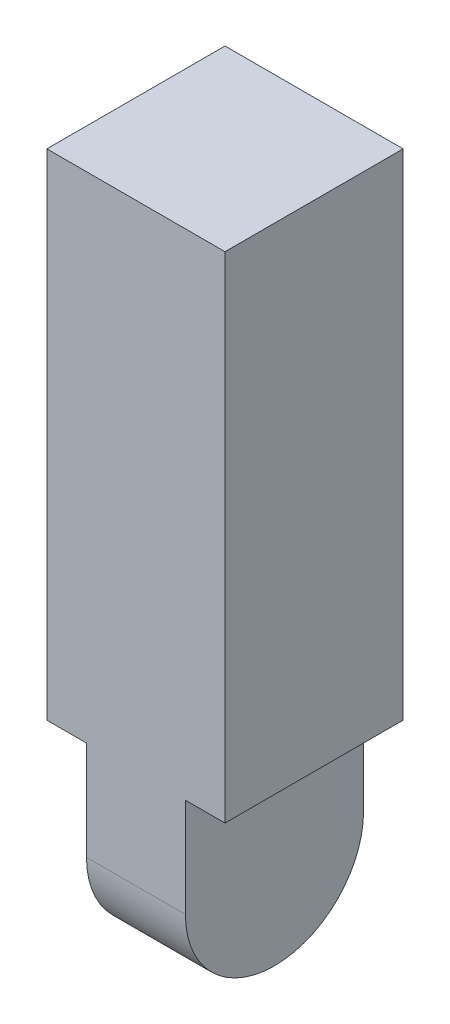
ISO-10303-21;
HEADER;
FILE_DESCRIPTION(('STEP AP214'),'2;1');
FILE_NAME('part.step','',(''),(''),'','','');
FILE_SCHEMA(('AUTOMOTIVE_DESIGN { 1 0 10303 214 1 1 1 1 }'));
ENDSEC;
DATA;
#1=APPLICATION_CONTEXT('core data for automotive mechanical design processes');
#2=APPLICATION_PROTOCOL_DEFINITION('international standard','automotive_design',2000,#1);
#3=PRODUCT_CONTEXT('',#1,'mechanical');
#4=PRODUCT('Part','Part','',(#3));
#5=PRODUCT_RELATED_PRODUCT_CATEGORY('part','',(#4));
#6=PRODUCT_DEFINITION_FORMATION('','',#4);
#7=PRODUCT_DEFINITION_CONTEXT('part definition',#1,'design');
#8=PRODUCT_DEFINITION('design','',#6,#7);
#9=PRODUCT_DEFINITION_SHAPE('','',#8);
#10=(LENGTH_UNIT() NAMED_UNIT(*) SI_UNIT(.MILLI.,.METRE.));
#11=(NAMED_UNIT(*) PLANE_ANGLE_UNIT() SI_UNIT($,.RADIAN.));
#12=(NAMED_UNIT(*) SI_UNIT($,.STERADIAN.) SOLID_ANGLE_UNIT());
#13=UNCERTAINTY_MEASURE_WITH_UNIT(LENGTH_MEASURE(1.E-05),#10,'distance_accuracy_value','');
#14=(GEOMETRIC_REPRESENTATION_CONTEXT(3) GLOBAL_UNCERTAINTY_ASSIGNED_CONTEXT((#13)) GLOBAL_UNIT_ASSIGNED_CONTEXT((#10,
#11,#12)) REPRESENTATION_CONTEXT('',''));
#15=CARTESIAN_POINT('',(0.,0.,0.));
#16=DIRECTION('',(0.,0.,1.));
#17=DIRECTION('',(1.,0.,0.));
#18=AXIS2_PLACEMENT_3D('',#15,#16,#17);
#19=CARTESIAN_POINT('',(0.,0.,0.));
#20=DIRECTION('',(0.,1.,0.));
#21=DIRECTION('',(0.,0.,1.));
#22=AXIS2_PLACEMENT_3D('',#19,#20,#21);
#23=PLANE('',#22);
#24=DIRECTION('',(0.,0.,-1.));
#25=VECTOR('',#24,1.);
#26=CARTESIAN_POINT('',(-5.,0.,0.));
#27=LINE('',#26,#25);
#28=CARTESIAN_POINT('',(-5.,0.,9.));
#29=VERTEX_POINT('',#28);
#30=CARTESIAN_POINT('',(-5.,0.,-9.));
#31=VERTEX_POINT('',#30);
#32=EDGE_CURVE('E40',#29,#31,#27,.T.);
#33=ORIENTED_EDGE('',*,*,#32,.F.);
#34=DIRECTION('',(1.,0.,0.));
#35=VECTOR('',#34,1.);
#36=CARTESIAN_POINT('',(-9.,0.,9.));
#37=LINE('',#36,#35);
#38=CARTESIAN_POINT('',(-9.,0.,9.));
#39=VERTEX_POINT('',#38);
#40=EDGE_CURVE('E139',#39,#29,#37,.T.);
#41=ORIENTED_EDGE('',*,*,#40,.F.);
#42=DIRECTION('',(0.,0.,1.));
#43=VECTOR('',#42,1.);
#44=CARTESIAN_POINT('',(-9.,0.,-9.));
#45=LINE('',#44,#43);
#46=CARTESIAN_POINT('',(-9.,0.,-9.));
#47=VERTEX_POINT('',#46);
#48=EDGE_CURVE('E121',#47,#39,#45,.T.);
#49=ORIENTED_EDGE('',*,*,#48,.F.);
#50=DIRECTION('',(-1.,0.,0.));
#51=VECTOR('',#50,1.);
#52=CARTESIAN_POINT('',(-9.,0.,-9.));
#53=LINE('',#52,#51);
#54=EDGE_CURVE('E143',#31,#47,#53,.T.);
#55=ORIENTED_EDGE('',*,*,#54,.F.);
#56=EDGE_LOOP('',(#33,#41,#49,#55));
#57=FACE_BOUND('',#56,.T.);
#58=ADVANCED_FACE('F32',(#57),#23,.F.);
#59=CARTESIAN_POINT('',(-9.,50.,-9.));
#60=DIRECTION('',(1.,0.,0.));
#61=DIRECTION('',(0.,0.,-1.));
#62=AXIS2_PLACEMENT_3D('',#59,#60,#61);
#63=PLANE('',#62);
#64=ORIENTED_EDGE('',*,*,#48,.T.);
#65=DIRECTION('',(0.,-1.,0.));
#66=VECTOR('',#65,1.);
#67=CARTESIAN_POINT('',(-9.,50.,9.));
#68=LINE('',#67,#66);
#69=CARTESIAN_POINT('',(-9.,50.,9.));
#70=VERTEX_POINT('',#69);
#71=EDGE_CURVE('E152',#70,#39,#68,.T.);
#72=ORIENTED_EDGE('',*,*,#71,.F.);
#73=DIRECTION('',(0.,0.,1.));
#74=VECTOR('',#73,1.);
#75=CARTESIAN_POINT('',(-9.,50.,-9.));
#76=LINE('',#75,#74);
#77=CARTESIAN_POINT('',(-9.,50.,-9.));
#78=VERTEX_POINT('',#77);
#79=EDGE_CURVE('E129',#78,#70,#76,.T.);
#80=ORIENTED_EDGE('',*,*,#79,.F.);
#81=DIRECTION('',(0.,-1.,0.));
#82=VECTOR('',#81,1.);
#83=CARTESIAN_POINT('',(-9.,50.,-9.));
#84=LINE('',#83,#82);
#85=EDGE_CURVE('E137',#78,#47,#84,.T.);
#86=ORIENTED_EDGE('',*,*,#85,.T.);
#87=EDGE_LOOP('',(#64,#72,#80,#86));
#88=FACE_BOUND('',#87,.T.);
#89=ADVANCED_FACE('F34',(#88),#63,.F.);
#90=CARTESIAN_POINT('',(-9.,50.,9.));
#91=DIRECTION('',(0.,0.,-1.));
#92=DIRECTION('',(-1.,0.,0.));
#93=AXIS2_PLACEMENT_3D('',#90,#91,#92);
#94=PLANE('',#93);
#95=DIRECTION('',(0.,-1.,0.));
#96=VECTOR('',#95,1.);
#97=CARTESIAN_POINT('',(5.,-10.,9.));
#98=LINE('',#97,#96);
#99=CARTESIAN_POINT('',(5.,0.,9.));
#100=VERTEX_POINT('',#99);
#101=CARTESIAN_POINT('',(5.,-10.,9.));
#102=VERTEX_POINT('',#101);
#103=EDGE_CURVE('E107',#100,#102,#98,.T.);
#104=ORIENTED_EDGE('',*,*,#103,.F.);
#105=CARTESIAN_POINT('',(9.,0.,9.));
#106=VERTEX_POINT('',#105);
#107=EDGE_CURVE('E46',#100,#106,#37,.T.);
#108=ORIENTED_EDGE('',*,*,#107,.T.);
#109=DIRECTION('',(0.,-1.,0.));
#110=VECTOR('',#109,1.);
#111=CARTESIAN_POINT('',(9.,50.,9.));
#112=LINE('',#111,#110);
#113=CARTESIAN_POINT('',(9.,50.,9.));
#114=VERTEX_POINT('',#113);
#115=EDGE_CURVE('E149',#114,#106,#112,.T.);
#116=ORIENTED_EDGE('',*,*,#115,.F.);
#117=DIRECTION('',(1.,0.,0.));
#118=VECTOR('',#117,1.);
#119=CARTESIAN_POINT('',(-9.,50.,9.));
#120=LINE('',#119,#118);
#121=EDGE_CURVE('E132',#70,#114,#120,.T.);
#122=ORIENTED_EDGE('',*,*,#121,.F.);
#123=ORIENTED_EDGE('',*,*,#71,.T.);
#124=ORIENTED_EDGE('',*,*,#40,.T.);
#125=DIRECTION('',(0.,-1.,0.));
#126=VECTOR('',#125,1.);
#127=CARTESIAN_POINT('',(-5.,-10.,9.));
#128=LINE('',#127,#126);
#129=CARTESIAN_POINT('',(-5.,-10.,9.));
#130=VERTEX_POINT('',#129);
#131=EDGE_CURVE('E116',#29,#130,#128,.T.);
#132=ORIENTED_EDGE('',*,*,#131,.T.);
#133=DIRECTION('',(-1.,0.,0.));
#134=VECTOR('',#133,1.);
#135=CARTESIAN_POINT('',(5.,-10.,9.));
#136=LINE('',#135,#134);
#137=EDGE_CURVE('E122',#102,#130,#136,.T.);
#138=ORIENTED_EDGE('',*,*,#137,.F.);
#139=EDGE_LOOP('',(#104,#108,#116,#122,#123,#124,#132,#138));
#140=FACE_BOUND('',#139,.T.);
#141=ADVANCED_FACE('F163',(#140),#94,.F.);
#142=CARTESIAN_POINT('',(9.,50.,-9.));
#143=DIRECTION('',(-1.,0.,0.));
#144=DIRECTION('',(0.,0.,1.));
#145=AXIS2_PLACEMENT_3D('',#142,#143,#144);
#146=PLANE('',#145);
#147=DIRECTION('',(0.,0.,-1.));
#148=VECTOR('',#147,1.);
#149=CARTESIAN_POINT('',(9.,0.,-9.));
#150=LINE('',#149,#148);
#151=CARTESIAN_POINT('',(9.,0.,-9.));
#152=VERTEX_POINT('',#151);
#153=EDGE_CURVE('E141',#106,#152,#150,.T.);
#154=ORIENTED_EDGE('',*,*,#153,.T.);
#155=DIRECTION('',(0.,-1.,0.));
#156=VECTOR('',#155,1.);
#157=CARTESIAN_POINT('',(9.,50.,-9.));
#158=LINE('',#157,#156);
#159=CARTESIAN_POINT('',(9.,50.,-9.));
#160=VERTEX_POINT('',#159);
#161=EDGE_CURVE('E147',#160,#152,#158,.T.);
#162=ORIENTED_EDGE('',*,*,#161,.F.);
#163=DIRECTION('',(0.,0.,-1.));
#164=VECTOR('',#163,1.);
#165=CARTESIAN_POINT('',(9.,50.,-9.));
#166=LINE('',#165,#164);
#167=EDGE_CURVE('E134',#114,#160,#166,.T.);
#168=ORIENTED_EDGE('',*,*,#167,.F.);
#169=ORIENTED_EDGE('',*,*,#115,.T.);
#170=EDGE_LOOP('',(#154,#162,#168,#169));
#171=FACE_BOUND('',#170,.T.);
#172=ADVANCED_FACE('F175',(#171),#146,.F.);
#173=CARTESIAN_POINT('',(-9.,50.,-9.));
#174=DIRECTION('',(0.,0.,1.));
#175=DIRECTION('',(1.,0.,0.));
#176=AXIS2_PLACEMENT_3D('',#173,#174,#175);
#177=PLANE('',#176);
#178=CARTESIAN_POINT('',(5.,0.,-9.));
#179=VERTEX_POINT('',#178);
#180=EDGE_CURVE('E105',#152,#179,#53,.T.);
#181=ORIENTED_EDGE('',*,*,#180,.T.);
#182=DIRECTION('',(0.,1.,0.));
#183=VECTOR('',#182,1.);
#184=CARTESIAN_POINT('',(5.,-10.,-9.));
#185=LINE('',#184,#183);
#186=CARTESIAN_POINT('',(5.,-10.,-9.));
#187=VERTEX_POINT('',#186);
#188=EDGE_CURVE('E96',#187,#179,#185,.T.);
#189=ORIENTED_EDGE('',*,*,#188,.F.);
#190=DIRECTION('',(-1.,0.,0.));
#191=VECTOR('',#190,1.);
#192=CARTESIAN_POINT('',(5.,-10.,-9.));
#193=LINE('',#192,#191);
#194=CARTESIAN_POINT('',(-5.,-10.,-9.));
#195=VERTEX_POINT('',#194);
#196=EDGE_CURVE('E101',#187,#195,#193,.T.);
#197=ORIENTED_EDGE('',*,*,#196,.T.);
#198=DIRECTION('',(0.,1.,0.));
#199=VECTOR('',#198,1.);
#200=CARTESIAN_POINT('',(-5.,-10.,-9.));
#201=LINE('',#200,#199);
#202=EDGE_CURVE('E157',#195,#31,#201,.T.);
#203=ORIENTED_EDGE('',*,*,#202,.T.);
#204=ORIENTED_EDGE('',*,*,#54,.T.);
#205=ORIENTED_EDGE('',*,*,#85,.F.);
#206=DIRECTION('',(-1.,0.,0.));
#207=VECTOR('',#206,1.);
#208=CARTESIAN_POINT('',(-9.,50.,-9.));
#209=LINE('',#208,#207);
#210=EDGE_CURVE('E136',#160,#78,#209,.T.);
#211=ORIENTED_EDGE('',*,*,#210,.F.);
#212=ORIENTED_EDGE('',*,*,#161,.T.);
#213=EDGE_LOOP('',(#181,#189,#197,#203,#204,#205,#211,#212));
#214=FACE_BOUND('',#213,.T.);
#215=ADVANCED_FACE('F98',(#214),#177,.F.);
#216=CARTESIAN_POINT('',(0.,50.,0.));
#217=DIRECTION('',(0.,1.,0.));
#218=DIRECTION('',(0.,0.,1.));
#219=AXIS2_PLACEMENT_3D('',#216,#217,#218);
#220=PLANE('',#219);
#221=ORIENTED_EDGE('',*,*,#79,.T.);
#222=ORIENTED_EDGE('',*,*,#121,.T.);
#223=ORIENTED_EDGE('',*,*,#167,.T.);
#224=ORIENTED_EDGE('',*,*,#210,.T.);
#225=EDGE_LOOP('',(#221,#222,#223,#224));
#226=FACE_BOUND('',#225,.T.);
#227=ADVANCED_FACE('F171',(#226),#220,.T.);
#228=ORIENTED_EDGE('',*,*,#107,.F.);
#229=DIRECTION('',(0.,0.,-1.));
#230=VECTOR('',#229,1.);
#231=CARTESIAN_POINT('',(5.,0.,0.));
#232=LINE('',#231,#230);
#233=EDGE_CURVE('E11',#100,#179,#232,.T.);
#234=ORIENTED_EDGE('',*,*,#233,.T.);
#235=ORIENTED_EDGE('',*,*,#180,.F.);
#236=ORIENTED_EDGE('',*,*,#153,.F.);
#237=EDGE_LOOP('',(#228,#234,#235,#236));
#238=FACE_BOUND('',#237,.T.);
#239=ADVANCED_FACE('F176',(#238),#23,.F.);
#240=CARTESIAN_POINT('',(5.,-10.,0.));
#241=DIRECTION('',(1.,0.,0.));
#242=DIRECTION('',(0.,0.,-1.));
#243=AXIS2_PLACEMENT_3D('',#240,#241,#242);
#244=PLANE('',#243);
#245=ORIENTED_EDGE('',*,*,#233,.F.);
#246=ORIENTED_EDGE('',*,*,#103,.T.);
#247=CARTESIAN_POINT('',(5.,-10.,0.));
#248=DIRECTION('',(1.,0.,0.));
#249=DIRECTION('',(0.,0.,-1.));
#250=AXIS2_PLACEMENT_3D('',#247,#248,#249);
#251=CIRCLE('',#250,9.);
#252=EDGE_CURVE('E108',#102,#187,#251,.T.);
#253=ORIENTED_EDGE('',*,*,#252,.T.);
#254=ORIENTED_EDGE('',*,*,#188,.T.);
#255=EDGE_LOOP('',(#245,#246,#253,#254));
#256=FACE_BOUND('',#255,.T.);
#257=ADVANCED_FACE('F111',(#256),#244,.T.);
#258=CARTESIAN_POINT('',(-5.,-10.,0.));
#259=DIRECTION('',(1.,0.,0.));
#260=DIRECTION('',(0.,0.,-1.));
#261=AXIS2_PLACEMENT_3D('',#258,#259,#260);
#262=PLANE('',#261);
#263=ORIENTED_EDGE('',*,*,#131,.F.);
#264=ORIENTED_EDGE('',*,*,#32,.T.);
#265=ORIENTED_EDGE('',*,*,#202,.F.);
#266=CARTESIAN_POINT('',(-5.,-10.,0.));
#267=DIRECTION('',(1.,0.,0.));
#268=DIRECTION('',(0.,0.,-1.));
#269=AXIS2_PLACEMENT_3D('',#266,#267,#268);
#270=CIRCLE('',#269,9.);
#271=EDGE_CURVE('E120',#130,#195,#270,.T.);
#272=ORIENTED_EDGE('',*,*,#271,.F.);
#273=EDGE_LOOP('',(#263,#264,#265,#272));
#274=FACE_BOUND('',#273,.T.);
#275=ADVANCED_FACE('F156',(#274),#262,.F.);
#276=CARTESIAN_POINT('',(5.,-10.,0.));
#277=DIRECTION('',(-1.,0.,0.));
#278=DIRECTION('',(0.,0.,1.));
#279=AXIS2_PLACEMENT_3D('',#276,#277,#278);
#280=CYLINDRICAL_SURFACE('',#279,9.);
#281=ORIENTED_EDGE('',*,*,#271,.T.);
#282=ORIENTED_EDGE('',*,*,#196,.F.);
#283=ORIENTED_EDGE('',*,*,#252,.F.);
#284=ORIENTED_EDGE('',*,*,#137,.T.);
#285=EDGE_LOOP('',(#281,#282,#283,#284));
#286=FACE_BOUND('',#285,.T.);
#287=ADVANCED_FACE('F118',(#286),#280,.T.);
#288=CLOSED_SHELL('',(#58,#89,#141,#172,#215,#227,#239,#257,#275,#287));
#289=MANIFOLD_SOLID_BREP('B2',#288);
#290=ADVANCED_BREP_SHAPE_REPRESENTATION('',(#18,#289),#14);
#291=SHAPE_DEFINITION_REPRESENTATION(#9,#290);
ENDSEC;
END-ISO-10303-21;
